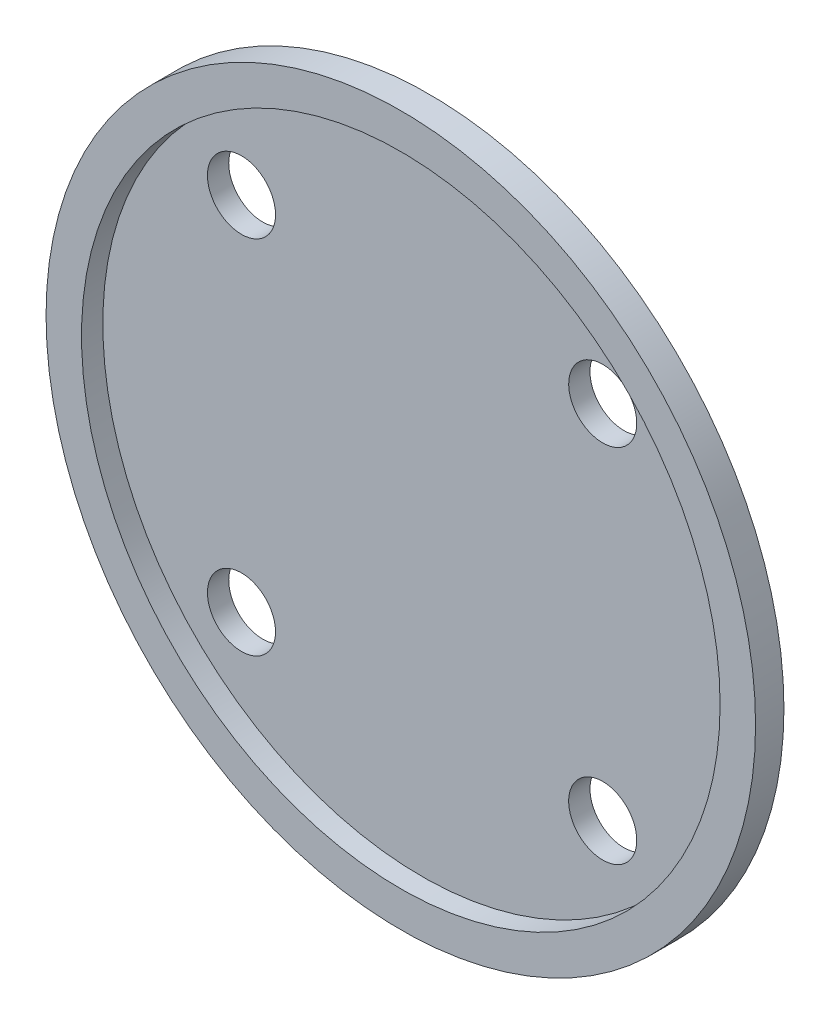
ISO-10303-21;
HEADER;
FILE_DESCRIPTION(('STEP AP214'),'2;1');
FILE_NAME('part.step','',(''),(''),'','','');
FILE_SCHEMA(('AUTOMOTIVE_DESIGN { 1 0 10303 214 1 1 1 1 }'));
ENDSEC;
DATA;
#1=APPLICATION_CONTEXT('core data for automotive mechanical design processes');
#2=APPLICATION_PROTOCOL_DEFINITION('international standard','automotive_design',2000,#1);
#3=PRODUCT_CONTEXT('',#1,'mechanical');
#4=PRODUCT('Part','Part','',(#3));
#5=PRODUCT_RELATED_PRODUCT_CATEGORY('part','',(#4));
#6=PRODUCT_DEFINITION_FORMATION('','',#4);
#7=PRODUCT_DEFINITION_CONTEXT('part definition',#1,'design');
#8=PRODUCT_DEFINITION('design','',#6,#7);
#9=PRODUCT_DEFINITION_SHAPE('','',#8);
#10=(LENGTH_UNIT() NAMED_UNIT(*) SI_UNIT(.MILLI.,.METRE.));
#11=(NAMED_UNIT(*) PLANE_ANGLE_UNIT() SI_UNIT($,.RADIAN.));
#12=(NAMED_UNIT(*) SI_UNIT($,.STERADIAN.) SOLID_ANGLE_UNIT());
#13=UNCERTAINTY_MEASURE_WITH_UNIT(LENGTH_MEASURE(1.E-05),#10,'distance_accuracy_value','');
#14=(GEOMETRIC_REPRESENTATION_CONTEXT(3) GLOBAL_UNCERTAINTY_ASSIGNED_CONTEXT((#13)) GLOBAL_UNIT_ASSIGNED_CONTEXT((#10,
#11,#12)) REPRESENTATION_CONTEXT('',''));
#15=CARTESIAN_POINT('',(0.,0.,0.));
#16=DIRECTION('',(0.,0.,1.));
#17=DIRECTION('',(1.,0.,0.));
#18=AXIS2_PLACEMENT_3D('',#15,#16,#17);
#19=CARTESIAN_POINT('',(0.,0.,2.));
#20=DIRECTION('',(0.,0.,1.));
#21=DIRECTION('',(1.,0.,0.));
#22=AXIS2_PLACEMENT_3D('',#19,#20,#21);
#23=PLANE('',#22);
#24=CARTESIAN_POINT('',(0.,0.,2.));
#25=DIRECTION('',(0.,0.,1.));
#26=DIRECTION('',(1.,0.,0.));
#27=AXIS2_PLACEMENT_3D('',#24,#25,#26);
#28=CIRCLE('',#27,25.);
#29=CARTESIAN_POINT('',(25.,0.,2.));
#30=VERTEX_POINT('',#29);
#31=EDGE_CURVE('E39',#30,#30,#28,.T.);
#32=ORIENTED_EDGE('',*,*,#31,.T.);
#33=EDGE_LOOP('',(#32));
#34=FACE_BOUND('',#33,.T.);
#35=CARTESIAN_POINT('',(0.,0.,2.));
#36=DIRECTION('',(0.,0.,1.));
#37=DIRECTION('',(1.,0.,0.));
#38=AXIS2_PLACEMENT_3D('',#35,#36,#37);
#39=CIRCLE('',#38,22.5);
#40=CARTESIAN_POINT('',(22.5,0.,2.));
#41=VERTEX_POINT('',#40);
#42=EDGE_CURVE('E51',#41,#41,#39,.T.);
#43=ORIENTED_EDGE('',*,*,#42,.F.);
#44=EDGE_LOOP('',(#43));
#45=FACE_BOUND('',#44,.T.);
#46=ADVANCED_FACE('F31',(#34,#45),#23,.T.);
#47=CARTESIAN_POINT('',(0.,0.,2.));
#48=DIRECTION('',(0.,0.,-1.));
#49=DIRECTION('',(-1.,0.,0.));
#50=AXIS2_PLACEMENT_3D('',#47,#48,#49);
#51=CYLINDRICAL_SURFACE('',#50,25.);
#52=ORIENTED_EDGE('',*,*,#31,.F.);
#53=EDGE_LOOP('',(#52));
#54=FACE_BOUND('',#53,.T.);
#55=CARTESIAN_POINT('',(0.,0.,0.));
#56=DIRECTION('',(0.,0.,1.));
#57=DIRECTION('',(1.,0.,0.));
#58=AXIS2_PLACEMENT_3D('',#55,#56,#57);
#59=CIRCLE('',#58,25.);
#60=CARTESIAN_POINT('',(25.,0.,0.));
#61=VERTEX_POINT('',#60);
#62=EDGE_CURVE('E44',#61,#61,#59,.T.);
#63=ORIENTED_EDGE('',*,*,#62,.T.);
#64=EDGE_LOOP('',(#63));
#65=FACE_BOUND('',#64,.T.);
#66=ADVANCED_FACE('F33',(#54,#65),#51,.T.);
#67=CARTESIAN_POINT('',(0.,0.,0.));
#68=DIRECTION('',(0.,0.,1.));
#69=DIRECTION('',(1.,0.,0.));
#70=AXIS2_PLACEMENT_3D('',#67,#68,#69);
#71=PLANE('',#70);
#72=CARTESIAN_POINT('',(0.,0.,0.));
#73=DIRECTION('',(0.,0.,1.));
#74=DIRECTION('',(1.,0.,0.));
#75=AXIS2_PLACEMENT_3D('',#72,#73,#74);
#76=CIRCLE('',#75,23.5);
#77=CARTESIAN_POINT('',(23.5,0.,0.));
#78=VERTEX_POINT('',#77);
#79=EDGE_CURVE('E75',#78,#78,#76,.T.);
#80=ORIENTED_EDGE('',*,*,#79,.T.);
#81=EDGE_LOOP('',(#80));
#82=FACE_BOUND('',#81,.T.);
#83=ORIENTED_EDGE('',*,*,#62,.F.);
#84=EDGE_LOOP('',(#83));
#85=FACE_BOUND('',#84,.T.);
#86=ADVANCED_FACE('F82',(#82,#85),#71,.F.);
#87=CARTESIAN_POINT('',(0.,0.,-1.));
#88=DIRECTION('',(0.,0.,1.));
#89=DIRECTION('',(1.,0.,0.));
#90=AXIS2_PLACEMENT_3D('',#87,#88,#89);
#91=CYLINDRICAL_SURFACE('',#90,23.5);
#92=CARTESIAN_POINT('',(0.,0.,-1.));
#93=DIRECTION('',(0.,0.,1.));
#94=DIRECTION('',(1.,0.,0.));
#95=AXIS2_PLACEMENT_3D('',#92,#93,#94);
#96=CIRCLE('',#95,23.5);
#97=CARTESIAN_POINT('',(23.5,0.,-1.));
#98=VERTEX_POINT('',#97);
#99=EDGE_CURVE('E76',#98,#98,#96,.T.);
#100=ORIENTED_EDGE('',*,*,#99,.T.);
#101=EDGE_LOOP('',(#100));
#102=FACE_BOUND('',#101,.T.);
#103=ORIENTED_EDGE('',*,*,#79,.F.);
#104=EDGE_LOOP('',(#103));
#105=FACE_BOUND('',#104,.T.);
#106=ADVANCED_FACE('F85',(#102,#105),#91,.T.);
#107=CARTESIAN_POINT('',(0.,0.,-1.));
#108=DIRECTION('',(0.,0.,1.));
#109=DIRECTION('',(1.,0.,0.));
#110=AXIS2_PLACEMENT_3D('',#107,#108,#109);
#111=PLANE('',#110);
#112=CARTESIAN_POINT('',(12.7279220613577,12.727922061358,-1.));
#113=DIRECTION('',(0.,0.,-1.));
#114=DIRECTION('',(0.,1.,0.));
#115=AXIS2_PLACEMENT_3D('',#112,#113,#114);
#116=CIRCLE('',#115,2.39851932664783);
#117=CARTESIAN_POINT('',(12.7279220613577,15.1264413880058,-1.));
#118=VERTEX_POINT('',#117);
#119=EDGE_CURVE('E68',#118,#118,#116,.T.);
#120=ORIENTED_EDGE('',*,*,#119,.F.);
#121=EDGE_LOOP('',(#120));
#122=FACE_BOUND('',#121,.T.);
#123=CARTESIAN_POINT('',(12.7279220613578,-12.7279220613579,-1.));
#124=DIRECTION('',(0.,0.,-1.));
#125=DIRECTION('',(1.,0.,0.));
#126=AXIS2_PLACEMENT_3D('',#123,#124,#125);
#127=CIRCLE('',#126,2.39851932664783);
#128=CARTESIAN_POINT('',(15.1264413880057,-12.7279220613579,-1.));
#129=VERTEX_POINT('',#128);
#130=EDGE_CURVE('E58',#129,#129,#127,.T.);
#131=ORIENTED_EDGE('',*,*,#130,.F.);
#132=EDGE_LOOP('',(#131));
#133=FACE_BOUND('',#132,.T.);
#134=CARTESIAN_POINT('',(-12.7279220613578,-12.7279220613579,-1.));
#135=DIRECTION('',(0.,0.,-1.));
#136=DIRECTION('',(0.,-1.,0.));
#137=AXIS2_PLACEMENT_3D('',#134,#135,#136);
#138=CIRCLE('',#137,2.39851932664783);
#139=CARTESIAN_POINT('',(-12.7279220613578,-15.1264413880057,-1.));
#140=VERTEX_POINT('',#139);
#141=EDGE_CURVE('E55',#140,#140,#138,.T.);
#142=ORIENTED_EDGE('',*,*,#141,.F.);
#143=EDGE_LOOP('',(#142));
#144=FACE_BOUND('',#143,.T.);
#145=CARTESIAN_POINT('',(-12.7279220613578,12.7279220613579,-1.));
#146=DIRECTION('',(0.,0.,-1.));
#147=DIRECTION('',(-1.,0.,0.));
#148=AXIS2_PLACEMENT_3D('',#145,#146,#147);
#149=CIRCLE('',#148,2.39851932664783);
#150=CARTESIAN_POINT('',(-15.1264413880057,12.7279220613579,-1.));
#151=VERTEX_POINT('',#150);
#152=EDGE_CURVE('E52',#151,#151,#149,.T.);
#153=ORIENTED_EDGE('',*,*,#152,.F.);
#154=EDGE_LOOP('',(#153));
#155=FACE_BOUND('',#154,.T.);
#156=ORIENTED_EDGE('',*,*,#99,.F.);
#157=EDGE_LOOP('',(#156));
#158=FACE_BOUND('',#157,.T.);
#159=ADVANCED_FACE('F87',(#122,#133,#144,#155,#158),#111,.F.);
#160=CARTESIAN_POINT('',(0.,0.,2.001));
#161=DIRECTION('',(0.,0.,-1.));
#162=DIRECTION('',(-1.,0.,0.));
#163=AXIS2_PLACEMENT_3D('',#160,#161,#162);
#164=CYLINDRICAL_SURFACE('',#163,22.5);
#165=CARTESIAN_POINT('',(0.,0.,0.5));
#166=DIRECTION('',(0.,0.,1.));
#167=DIRECTION('',(1.,0.,0.));
#168=AXIS2_PLACEMENT_3D('',#165,#166,#167);
#169=CIRCLE('',#168,22.5);
#170=CARTESIAN_POINT('',(22.5,0.,0.5));
#171=VERTEX_POINT('',#170);
#172=EDGE_CURVE('E10',#171,#171,#169,.T.);
#173=ORIENTED_EDGE('',*,*,#172,.F.);
#174=EDGE_LOOP('',(#173));
#175=FACE_BOUND('',#174,.T.);
#176=ORIENTED_EDGE('',*,*,#42,.T.);
#177=EDGE_LOOP('',(#176));
#178=FACE_BOUND('',#177,.T.);
#179=ADVANCED_FACE('F94',(#175,#178),#164,.F.);
#180=CARTESIAN_POINT('',(0.,0.,0.5));
#181=DIRECTION('',(0.,0.,1.));
#182=DIRECTION('',(1.,0.,0.));
#183=AXIS2_PLACEMENT_3D('',#180,#181,#182);
#184=PLANE('',#183);
#185=CARTESIAN_POINT('',(12.7279220613577,12.727922061358,0.5));
#186=DIRECTION('',(0.,0.,1.));
#187=DIRECTION('',(1.,0.,0.));
#188=AXIS2_PLACEMENT_3D('',#185,#186,#187);
#189=CIRCLE('',#188,2.39851932664783);
#190=CARTESIAN_POINT('',(15.1264413880056,12.727922061358,0.5));
#191=VERTEX_POINT('',#190);
#192=EDGE_CURVE('E35',#191,#191,#189,.T.);
#193=ORIENTED_EDGE('',*,*,#192,.F.);
#194=EDGE_LOOP('',(#193));
#195=FACE_BOUND('',#194,.T.);
#196=CARTESIAN_POINT('',(12.7279220613578,-12.7279220613579,0.5));
#197=DIRECTION('',(0.,0.,1.));
#198=DIRECTION('',(1.,0.,0.));
#199=AXIS2_PLACEMENT_3D('',#196,#197,#198);
#200=CIRCLE('',#199,2.39851932664783);
#201=CARTESIAN_POINT('',(15.1264413880057,-12.7279220613579,0.5));
#202=VERTEX_POINT('',#201);
#203=EDGE_CURVE('E56',#202,#202,#200,.T.);
#204=ORIENTED_EDGE('',*,*,#203,.F.);
#205=EDGE_LOOP('',(#204));
#206=FACE_BOUND('',#205,.T.);
#207=CARTESIAN_POINT('',(-12.7279220613578,-12.7279220613579,0.5));
#208=DIRECTION('',(0.,0.,1.));
#209=DIRECTION('',(1.,0.,0.));
#210=AXIS2_PLACEMENT_3D('',#207,#208,#209);
#211=CIRCLE('',#210,2.39851932664783);
#212=CARTESIAN_POINT('',(-10.32940273471,-12.7279220613579,0.5));
#213=VERTEX_POINT('',#212);
#214=EDGE_CURVE('E53',#213,#213,#211,.T.);
#215=ORIENTED_EDGE('',*,*,#214,.F.);
#216=EDGE_LOOP('',(#215));
#217=FACE_BOUND('',#216,.T.);
#218=CARTESIAN_POINT('',(-12.7279220613578,12.7279220613579,0.5));
#219=DIRECTION('',(0.,0.,1.));
#220=DIRECTION('',(1.,0.,0.));
#221=AXIS2_PLACEMENT_3D('',#218,#219,#220);
#222=CIRCLE('',#221,2.39851932664783);
#223=CARTESIAN_POINT('',(-10.32940273471,12.7279220613579,0.5));
#224=VERTEX_POINT('',#223);
#225=EDGE_CURVE('E48',#224,#224,#222,.T.);
#226=ORIENTED_EDGE('',*,*,#225,.F.);
#227=EDGE_LOOP('',(#226));
#228=FACE_BOUND('',#227,.T.);
#229=ORIENTED_EDGE('',*,*,#172,.T.);
#230=EDGE_LOOP('',(#229));
#231=FACE_BOUND('',#230,.T.);
#232=ADVANCED_FACE('F109',(#195,#206,#217,#228,#231),#184,.T.);
#233=CARTESIAN_POINT('',(-12.7279220613578,12.7279220613579,9.5));
#234=DIRECTION('',(0.,0.,-1.));
#235=DIRECTION('',(-1.,0.,0.));
#236=AXIS2_PLACEMENT_3D('',#233,#234,#235);
#237=CYLINDRICAL_SURFACE('',#236,2.39851932664783);
#238=ORIENTED_EDGE('',*,*,#225,.T.);
#239=EDGE_LOOP('',(#238));
#240=FACE_BOUND('',#239,.T.);
#241=ORIENTED_EDGE('',*,*,#152,.T.);
#242=EDGE_LOOP('',(#241));
#243=FACE_BOUND('',#242,.T.);
#244=ADVANCED_FACE('F115',(#240,#243),#237,.F.);
#245=CARTESIAN_POINT('',(-12.7279220613578,-12.7279220613579,9.5));
#246=DIRECTION('',(0.,0.,-1.));
#247=DIRECTION('',(-1.,0.,0.));
#248=AXIS2_PLACEMENT_3D('',#245,#246,#247);
#249=CYLINDRICAL_SURFACE('',#248,2.39851932664783);
#250=ORIENTED_EDGE('',*,*,#214,.T.);
#251=EDGE_LOOP('',(#250));
#252=FACE_BOUND('',#251,.T.);
#253=ORIENTED_EDGE('',*,*,#141,.T.);
#254=EDGE_LOOP('',(#253));
#255=FACE_BOUND('',#254,.T.);
#256=ADVANCED_FACE('F121',(#252,#255),#249,.F.);
#257=CARTESIAN_POINT('',(12.7279220613578,-12.7279220613579,9.5));
#258=DIRECTION('',(0.,0.,-1.));
#259=DIRECTION('',(-1.,0.,0.));
#260=AXIS2_PLACEMENT_3D('',#257,#258,#259);
#261=CYLINDRICAL_SURFACE('',#260,2.39851932664783);
#262=ORIENTED_EDGE('',*,*,#203,.T.);
#263=EDGE_LOOP('',(#262));
#264=FACE_BOUND('',#263,.T.);
#265=ORIENTED_EDGE('',*,*,#130,.T.);
#266=EDGE_LOOP('',(#265));
#267=FACE_BOUND('',#266,.T.);
#268=ADVANCED_FACE('F125',(#264,#267),#261,.F.);
#269=CARTESIAN_POINT('',(12.7279220613577,12.727922061358,9.5));
#270=DIRECTION('',(0.,0.,-1.));
#271=DIRECTION('',(-1.,0.,0.));
#272=AXIS2_PLACEMENT_3D('',#269,#270,#271);
#273=CYLINDRICAL_SURFACE('',#272,2.39851932664783);
#274=ORIENTED_EDGE('',*,*,#192,.T.);
#275=EDGE_LOOP('',(#274));
#276=FACE_BOUND('',#275,.T.);
#277=ORIENTED_EDGE('',*,*,#119,.T.);
#278=EDGE_LOOP('',(#277));
#279=FACE_BOUND('',#278,.T.);
#280=ADVANCED_FACE('F129',(#276,#279),#273,.F.);
#281=CLOSED_SHELL('',(#46,#66,#86,#106,#159,#179,#232,#244,#256,#268,#280));
#282=MANIFOLD_SOLID_BREP('B2',#281);
#283=ADVANCED_BREP_SHAPE_REPRESENTATION('',(#18,#282),#14);
#284=SHAPE_DEFINITION_REPRESENTATION(#9,#283);
ENDSEC;
END-ISO-10303-21;
